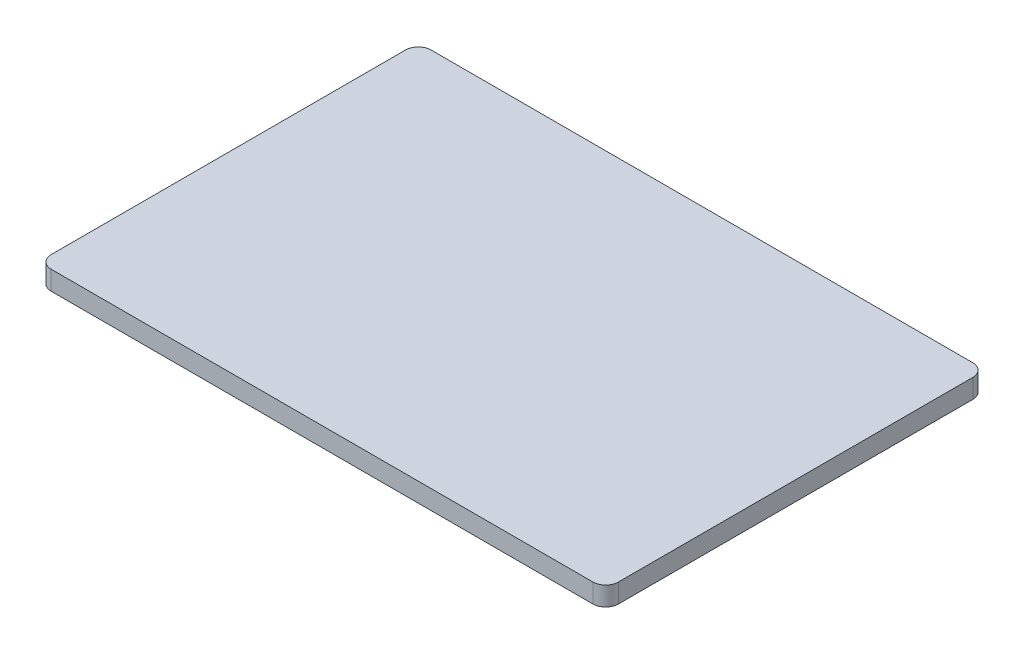
ISO-10303-21;
HEADER;
FILE_DESCRIPTION(('STEP AP214'),'2;1');
FILE_NAME('part.step','',(''),(''),'','','');
FILE_SCHEMA(('AUTOMOTIVE_DESIGN { 1 0 10303 214 1 1 1 1 }'));
ENDSEC;
DATA;
#1=APPLICATION_CONTEXT('core data for automotive mechanical design processes');
#2=APPLICATION_PROTOCOL_DEFINITION('international standard','automotive_design',2000,#1);
#3=PRODUCT_CONTEXT('',#1,'mechanical');
#4=PRODUCT('Part','Part','',(#3));
#5=PRODUCT_RELATED_PRODUCT_CATEGORY('part','',(#4));
#6=PRODUCT_DEFINITION_FORMATION('','',#4);
#7=PRODUCT_DEFINITION_CONTEXT('part definition',#1,'design');
#8=PRODUCT_DEFINITION('design','',#6,#7);
#9=PRODUCT_DEFINITION_SHAPE('','',#8);
#10=(LENGTH_UNIT() NAMED_UNIT(*) SI_UNIT(.MILLI.,.METRE.));
#11=(NAMED_UNIT(*) PLANE_ANGLE_UNIT() SI_UNIT($,.RADIAN.));
#12=(NAMED_UNIT(*) SI_UNIT($,.STERADIAN.) SOLID_ANGLE_UNIT());
#13=UNCERTAINTY_MEASURE_WITH_UNIT(LENGTH_MEASURE(1.E-05),#10,'distance_accuracy_value','');
#14=(GEOMETRIC_REPRESENTATION_CONTEXT(3) GLOBAL_UNCERTAINTY_ASSIGNED_CONTEXT((#13)) GLOBAL_UNIT_ASSIGNED_CONTEXT((#10,
#11,#12)) REPRESENTATION_CONTEXT('',''));
#15=CARTESIAN_POINT('',(0.,0.,0.));
#16=DIRECTION('',(0.,0.,1.));
#17=DIRECTION('',(1.,0.,0.));
#18=AXIS2_PLACEMENT_3D('',#15,#16,#17);
#19=CARTESIAN_POINT('',(44.5196,2.9972,-29.813));
#20=DIRECTION('',(-1.,0.,0.));
#21=DIRECTION('',(0.,0.,1.));
#22=AXIS2_PLACEMENT_3D('',#19,#20,#21);
#23=PLANE('',#22);
#24=DIRECTION('',(0.,0.,-1.));
#25=VECTOR('',#24,1.);
#26=CARTESIAN_POINT('',(44.5196,0.,-29.813));
#27=LINE('',#26,#25);
#28=CARTESIAN_POINT('',(44.5196,0.,27.813));
#29=VERTEX_POINT('',#28);
#30=CARTESIAN_POINT('',(44.5196,0.,-27.813));
#31=VERTEX_POINT('',#30);
#32=EDGE_CURVE('E186',#29,#31,#27,.T.);
#33=ORIENTED_EDGE('',*,*,#32,.T.);
#34=DIRECTION('',(0.,-1.,0.));
#35=VECTOR('',#34,1.);
#36=CARTESIAN_POINT('',(44.5196,2.9972,-27.813));
#37=LINE('',#36,#35);
#38=CARTESIAN_POINT('',(44.5196,2.9972,-27.813));
#39=VERTEX_POINT('',#38);
#40=EDGE_CURVE('E11',#31,#39,#37,.F.);
#41=ORIENTED_EDGE('',*,*,#40,.T.);
#42=DIRECTION('',(0.,0.,-1.));
#43=VECTOR('',#42,1.);
#44=CARTESIAN_POINT('',(44.5196,2.9972,-29.813));
#45=LINE('',#44,#43);
#46=CARTESIAN_POINT('',(44.5196,2.9972,27.813));
#47=VERTEX_POINT('',#46);
#48=EDGE_CURVE('E139',#47,#39,#45,.T.);
#49=ORIENTED_EDGE('',*,*,#48,.F.);
#50=DIRECTION('',(0.,-1.,0.));
#51=VECTOR('',#50,1.);
#52=CARTESIAN_POINT('',(44.5196,2.9972,27.813));
#53=LINE('',#52,#51);
#54=EDGE_CURVE('E52',#47,#29,#53,.T.);
#55=ORIENTED_EDGE('',*,*,#54,.T.);
#56=EDGE_LOOP('',(#33,#41,#49,#55));
#57=FACE_BOUND('',#56,.T.);
#58=ADVANCED_FACE('F43',(#57),#23,.F.);
#59=CARTESIAN_POINT('',(-44.5196,2.9972,-29.813));
#60=DIRECTION('',(0.,0.,1.));
#61=DIRECTION('',(1.,0.,0.));
#62=AXIS2_PLACEMENT_3D('',#59,#60,#61);
#63=PLANE('',#62);
#64=DIRECTION('',(-1.,0.,0.));
#65=VECTOR('',#64,1.);
#66=CARTESIAN_POINT('',(-44.5196,0.,-29.813));
#67=LINE('',#66,#65);
#68=CARTESIAN_POINT('',(42.5196,0.,-29.813));
#69=VERTEX_POINT('',#68);
#70=CARTESIAN_POINT('',(-42.5196,0.,-29.813));
#71=VERTEX_POINT('',#70);
#72=EDGE_CURVE('E146',#69,#71,#67,.T.);
#73=ORIENTED_EDGE('',*,*,#72,.T.);
#74=DIRECTION('',(0.,-1.,0.));
#75=VECTOR('',#74,1.);
#76=CARTESIAN_POINT('',(-42.5196,2.9972,-29.813));
#77=LINE('',#76,#75);
#78=CARTESIAN_POINT('',(-42.5196,2.9972,-29.813));
#79=VERTEX_POINT('',#78);
#80=EDGE_CURVE('E59',#71,#79,#77,.F.);
#81=ORIENTED_EDGE('',*,*,#80,.T.);
#82=DIRECTION('',(-1.,0.,0.));
#83=VECTOR('',#82,1.);
#84=CARTESIAN_POINT('',(-44.5196,2.9972,-29.813));
#85=LINE('',#84,#83);
#86=CARTESIAN_POINT('',(42.5196,2.9972,-29.813));
#87=VERTEX_POINT('',#86);
#88=EDGE_CURVE('E144',#87,#79,#85,.T.);
#89=ORIENTED_EDGE('',*,*,#88,.F.);
#90=DIRECTION('',(0.,-1.,0.));
#91=VECTOR('',#90,1.);
#92=CARTESIAN_POINT('',(42.5196,2.9972,-29.813));
#93=LINE('',#92,#91);
#94=EDGE_CURVE('E175',#87,#69,#93,.T.);
#95=ORIENTED_EDGE('',*,*,#94,.T.);
#96=EDGE_LOOP('',(#73,#81,#89,#95));
#97=FACE_BOUND('',#96,.T.);
#98=ADVANCED_FACE('F211',(#97),#63,.F.);
#99=CARTESIAN_POINT('',(-44.5196,2.9972,-29.813));
#100=DIRECTION('',(1.,0.,0.));
#101=DIRECTION('',(0.,0.,-1.));
#102=AXIS2_PLACEMENT_3D('',#99,#100,#101);
#103=PLANE('',#102);
#104=DIRECTION('',(0.,0.,1.));
#105=VECTOR('',#104,1.);
#106=CARTESIAN_POINT('',(-44.5196,0.,-29.813));
#107=LINE('',#106,#105);
#108=CARTESIAN_POINT('',(-44.5196,0.,-27.813));
#109=VERTEX_POINT('',#108);
#110=CARTESIAN_POINT('',(-44.5196,0.,27.813));
#111=VERTEX_POINT('',#110);
#112=EDGE_CURVE('E140',#109,#111,#107,.T.);
#113=ORIENTED_EDGE('',*,*,#112,.T.);
#114=DIRECTION('',(0.,-1.,0.));
#115=VECTOR('',#114,1.);
#116=CARTESIAN_POINT('',(-44.5196,2.9972,27.813));
#117=LINE('',#116,#115);
#118=CARTESIAN_POINT('',(-44.5196,2.9972,27.813));
#119=VERTEX_POINT('',#118);
#120=EDGE_CURVE('E115',#111,#119,#117,.F.);
#121=ORIENTED_EDGE('',*,*,#120,.T.);
#122=DIRECTION('',(0.,0.,1.));
#123=VECTOR('',#122,1.);
#124=CARTESIAN_POINT('',(-44.5196,2.9972,-29.813));
#125=LINE('',#124,#123);
#126=CARTESIAN_POINT('',(-44.5196,2.9972,-27.813));
#127=VERTEX_POINT('',#126);
#128=EDGE_CURVE('E197',#127,#119,#125,.T.);
#129=ORIENTED_EDGE('',*,*,#128,.F.);
#130=DIRECTION('',(0.,-1.,0.));
#131=VECTOR('',#130,1.);
#132=CARTESIAN_POINT('',(-44.5196,2.9972,-27.813));
#133=LINE('',#132,#131);
#134=EDGE_CURVE('E121',#127,#109,#133,.T.);
#135=ORIENTED_EDGE('',*,*,#134,.T.);
#136=EDGE_LOOP('',(#113,#121,#129,#135));
#137=FACE_BOUND('',#136,.T.);
#138=ADVANCED_FACE('F210',(#137),#103,.F.);
#139=CARTESIAN_POINT('',(-44.5196,2.9972,29.813));
#140=DIRECTION('',(0.,0.,-1.));
#141=DIRECTION('',(-1.,0.,0.));
#142=AXIS2_PLACEMENT_3D('',#139,#140,#141);
#143=PLANE('',#142);
#144=DIRECTION('',(1.,0.,0.));
#145=VECTOR('',#144,1.);
#146=CARTESIAN_POINT('',(-44.5196,2.9972,29.813));
#147=LINE('',#146,#145);
#148=CARTESIAN_POINT('',(-42.5196,2.9972,29.813));
#149=VERTEX_POINT('',#148);
#150=CARTESIAN_POINT('',(42.5196,2.9972,29.813));
#151=VERTEX_POINT('',#150);
#152=EDGE_CURVE('E131',#149,#151,#147,.T.);
#153=ORIENTED_EDGE('',*,*,#152,.F.);
#154=DIRECTION('',(0.,-1.,0.));
#155=VECTOR('',#154,1.);
#156=CARTESIAN_POINT('',(-42.5196,2.9972,29.813));
#157=LINE('',#156,#155);
#158=CARTESIAN_POINT('',(-42.5196,0.,29.813));
#159=VERTEX_POINT('',#158);
#160=EDGE_CURVE('E114',#149,#159,#157,.T.);
#161=ORIENTED_EDGE('',*,*,#160,.T.);
#162=DIRECTION('',(1.,0.,0.));
#163=VECTOR('',#162,1.);
#164=CARTESIAN_POINT('',(-44.5196,0.,29.813));
#165=LINE('',#164,#163);
#166=CARTESIAN_POINT('',(42.5196,0.,29.813));
#167=VERTEX_POINT('',#166);
#168=EDGE_CURVE('E128',#159,#167,#165,.T.);
#169=ORIENTED_EDGE('',*,*,#168,.T.);
#170=DIRECTION('',(0.,-1.,0.));
#171=VECTOR('',#170,1.);
#172=CARTESIAN_POINT('',(42.5196,2.9972,29.813));
#173=LINE('',#172,#171);
#174=EDGE_CURVE('E134',#167,#151,#173,.F.);
#175=ORIENTED_EDGE('',*,*,#174,.T.);
#176=EDGE_LOOP('',(#153,#161,#169,#175));
#177=FACE_BOUND('',#176,.T.);
#178=ADVANCED_FACE('F127',(#177),#143,.F.);
#179=CARTESIAN_POINT('',(0.,2.9972,0.));
#180=DIRECTION('',(0.,1.,0.));
#181=DIRECTION('',(0.,0.,1.));
#182=AXIS2_PLACEMENT_3D('',#179,#180,#181);
#183=PLANE('',#182);
#184=ORIENTED_EDGE('',*,*,#128,.T.);
#185=CARTESIAN_POINT('',(-42.5196,2.9972,27.813));
#186=DIRECTION('',(0.,1.,0.));
#187=DIRECTION('',(0.,0.,1.));
#188=AXIS2_PLACEMENT_3D('',#185,#186,#187);
#189=CIRCLE('',#188,2.);
#190=EDGE_CURVE('E172',#119,#149,#189,.T.);
#191=ORIENTED_EDGE('',*,*,#190,.T.);
#192=ORIENTED_EDGE('',*,*,#152,.T.);
#193=CARTESIAN_POINT('',(42.5196,2.9972,27.813));
#194=DIRECTION('',(0.,1.,0.));
#195=DIRECTION('',(0.,0.,1.));
#196=AXIS2_PLACEMENT_3D('',#193,#194,#195);
#197=CIRCLE('',#196,2.);
#198=EDGE_CURVE('E164',#151,#47,#197,.T.);
#199=ORIENTED_EDGE('',*,*,#198,.T.);
#200=ORIENTED_EDGE('',*,*,#48,.T.);
#201=CARTESIAN_POINT('',(42.5196,2.9972,-27.813));
#202=DIRECTION('',(0.,1.,0.));
#203=DIRECTION('',(0.,0.,1.));
#204=AXIS2_PLACEMENT_3D('',#201,#202,#203);
#205=CIRCLE('',#204,2.);
#206=EDGE_CURVE('E66',#39,#87,#205,.T.);
#207=ORIENTED_EDGE('',*,*,#206,.T.);
#208=ORIENTED_EDGE('',*,*,#88,.T.);
#209=CARTESIAN_POINT('',(-42.5196,2.9972,-27.813));
#210=DIRECTION('',(0.,1.,0.));
#211=DIRECTION('',(0.,0.,1.));
#212=AXIS2_PLACEMENT_3D('',#209,#210,#211);
#213=CIRCLE('',#212,2.);
#214=EDGE_CURVE('E169',#79,#127,#213,.T.);
#215=ORIENTED_EDGE('',*,*,#214,.T.);
#216=EDGE_LOOP('',(#184,#191,#192,#199,#200,#207,#208,#215));
#217=FACE_BOUND('',#216,.T.);
#218=ADVANCED_FACE('F203',(#217),#183,.T.);
#219=CARTESIAN_POINT('',(0.,0.,0.));
#220=DIRECTION('',(0.,1.,0.));
#221=DIRECTION('',(0.,0.,1.));
#222=AXIS2_PLACEMENT_3D('',#219,#220,#221);
#223=PLANE('',#222);
#224=ORIENTED_EDGE('',*,*,#168,.F.);
#225=CARTESIAN_POINT('',(-42.5196,0.,27.813));
#226=DIRECTION('',(0.,1.,0.));
#227=DIRECTION('',(0.,0.,1.));
#228=AXIS2_PLACEMENT_3D('',#225,#226,#227);
#229=CIRCLE('',#228,2.);
#230=EDGE_CURVE('E110',#159,#111,#229,.F.);
#231=ORIENTED_EDGE('',*,*,#230,.T.);
#232=ORIENTED_EDGE('',*,*,#112,.F.);
#233=CARTESIAN_POINT('',(-42.5196,0.,-27.813));
#234=DIRECTION('',(0.,1.,0.));
#235=DIRECTION('',(0.,0.,1.));
#236=AXIS2_PLACEMENT_3D('',#233,#234,#235);
#237=CIRCLE('',#236,2.);
#238=EDGE_CURVE('E122',#109,#71,#237,.F.);
#239=ORIENTED_EDGE('',*,*,#238,.T.);
#240=ORIENTED_EDGE('',*,*,#72,.F.);
#241=CARTESIAN_POINT('',(42.5196,0.,-27.813));
#242=DIRECTION('',(0.,1.,0.));
#243=DIRECTION('',(0.,0.,1.));
#244=AXIS2_PLACEMENT_3D('',#241,#242,#243);
#245=CIRCLE('',#244,2.);
#246=EDGE_CURVE('E154',#69,#31,#245,.F.);
#247=ORIENTED_EDGE('',*,*,#246,.T.);
#248=ORIENTED_EDGE('',*,*,#32,.F.);
#249=CARTESIAN_POINT('',(42.5196,0.,27.813));
#250=DIRECTION('',(0.,1.,0.));
#251=DIRECTION('',(0.,0.,1.));
#252=AXIS2_PLACEMENT_3D('',#249,#250,#251);
#253=CIRCLE('',#252,2.);
#254=EDGE_CURVE('E133',#29,#167,#253,.F.);
#255=ORIENTED_EDGE('',*,*,#254,.T.);
#256=EDGE_LOOP('',(#224,#231,#232,#239,#240,#247,#248,#255));
#257=FACE_BOUND('',#256,.T.);
#258=ADVANCED_FACE('F136',(#257),#223,.F.);
#259=CARTESIAN_POINT('',(-42.5196,2.9972,27.813));
#260=DIRECTION('',(0.,-1.,0.));
#261=DIRECTION('',(0.,0.,-1.));
#262=AXIS2_PLACEMENT_3D('',#259,#260,#261);
#263=CYLINDRICAL_SURFACE('',#262,2.);
#264=ORIENTED_EDGE('',*,*,#190,.F.);
#265=ORIENTED_EDGE('',*,*,#120,.F.);
#266=ORIENTED_EDGE('',*,*,#230,.F.);
#267=ORIENTED_EDGE('',*,*,#160,.F.);
#268=EDGE_LOOP('',(#264,#265,#266,#267));
#269=FACE_BOUND('',#268,.T.);
#270=ADVANCED_FACE('F113',(#269),#263,.T.);
#271=CARTESIAN_POINT('',(-42.5196,2.9972,-27.813));
#272=DIRECTION('',(0.,-1.,0.));
#273=DIRECTION('',(0.,0.,-1.));
#274=AXIS2_PLACEMENT_3D('',#271,#272,#273);
#275=CYLINDRICAL_SURFACE('',#274,2.);
#276=ORIENTED_EDGE('',*,*,#214,.F.);
#277=ORIENTED_EDGE('',*,*,#80,.F.);
#278=ORIENTED_EDGE('',*,*,#238,.F.);
#279=ORIENTED_EDGE('',*,*,#134,.F.);
#280=EDGE_LOOP('',(#276,#277,#278,#279));
#281=FACE_BOUND('',#280,.T.);
#282=ADVANCED_FACE('F208',(#281),#275,.T.);
#283=CARTESIAN_POINT('',(42.5196,2.9972,-27.813));
#284=DIRECTION('',(0.,-1.,0.));
#285=DIRECTION('',(0.,0.,-1.));
#286=AXIS2_PLACEMENT_3D('',#283,#284,#285);
#287=CYLINDRICAL_SURFACE('',#286,2.);
#288=ORIENTED_EDGE('',*,*,#206,.F.);
#289=ORIENTED_EDGE('',*,*,#40,.F.);
#290=ORIENTED_EDGE('',*,*,#246,.F.);
#291=ORIENTED_EDGE('',*,*,#94,.F.);
#292=EDGE_LOOP('',(#288,#289,#290,#291));
#293=FACE_BOUND('',#292,.T.);
#294=ADVANCED_FACE('F213',(#293),#287,.T.);
#295=CARTESIAN_POINT('',(42.5196,2.9972,27.813));
#296=DIRECTION('',(0.,-1.,0.));
#297=DIRECTION('',(0.,0.,-1.));
#298=AXIS2_PLACEMENT_3D('',#295,#296,#297);
#299=CYLINDRICAL_SURFACE('',#298,2.);
#300=ORIENTED_EDGE('',*,*,#198,.F.);
#301=ORIENTED_EDGE('',*,*,#174,.F.);
#302=ORIENTED_EDGE('',*,*,#254,.F.);
#303=ORIENTED_EDGE('',*,*,#54,.F.);
#304=EDGE_LOOP('',(#300,#301,#302,#303));
#305=FACE_BOUND('',#304,.T.);
#306=ADVANCED_FACE('F45',(#305),#299,.T.);
#307=CLOSED_SHELL('',(#58,#98,#138,#178,#218,#258,#270,#282,#294,#306));
#308=MANIFOLD_SOLID_BREP('B2',#307);
#309=ADVANCED_BREP_SHAPE_REPRESENTATION('',(#18,#308),#14);
#310=SHAPE_DEFINITION_REPRESENTATION(#9,#309);
ENDSEC;
END-ISO-10303-21;
